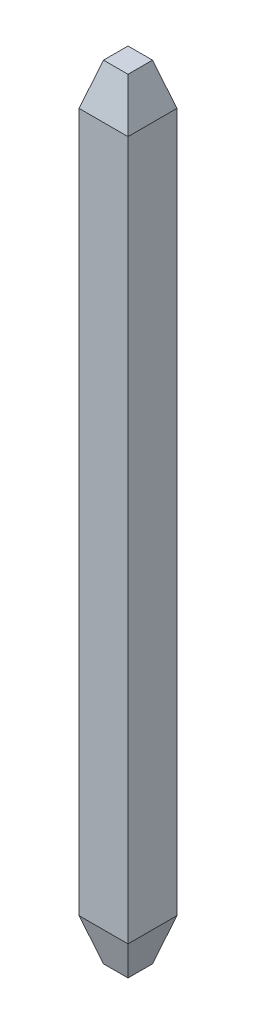
ISO-10303-21;
HEADER;
FILE_DESCRIPTION(('STEP AP214'),'2;1');
FILE_NAME('part.step','',(''),(''),'','','');
FILE_SCHEMA(('AUTOMOTIVE_DESIGN { 1 0 10303 214 1 1 1 1 }'));
ENDSEC;
DATA;
#1=APPLICATION_CONTEXT('core data for automotive mechanical design processes');
#2=APPLICATION_PROTOCOL_DEFINITION('international standard','automotive_design',2000,#1);
#3=PRODUCT_CONTEXT('',#1,'mechanical');
#4=PRODUCT('Part','Part','',(#3));
#5=PRODUCT_RELATED_PRODUCT_CATEGORY('part','',(#4));
#6=PRODUCT_DEFINITION_FORMATION('','',#4);
#7=PRODUCT_DEFINITION_CONTEXT('part definition',#1,'design');
#8=PRODUCT_DEFINITION('design','',#6,#7);
#9=PRODUCT_DEFINITION_SHAPE('','',#8);
#10=(LENGTH_UNIT() NAMED_UNIT(*) SI_UNIT(.MILLI.,.METRE.));
#11=(NAMED_UNIT(*) PLANE_ANGLE_UNIT() SI_UNIT($,.RADIAN.));
#12=(NAMED_UNIT(*) SI_UNIT($,.STERADIAN.) SOLID_ANGLE_UNIT());
#13=UNCERTAINTY_MEASURE_WITH_UNIT(LENGTH_MEASURE(1.E-05),#10,'distance_accuracy_value','');
#14=(GEOMETRIC_REPRESENTATION_CONTEXT(3) GLOBAL_UNCERTAINTY_ASSIGNED_CONTEXT((#13)) GLOBAL_UNIT_ASSIGNED_CONTEXT((#10,
#11,#12)) REPRESENTATION_CONTEXT('',''));
#15=CARTESIAN_POINT('',(0.,0.,0.));
#16=DIRECTION('',(0.,0.,1.));
#17=DIRECTION('',(1.,0.,0.));
#18=AXIS2_PLACEMENT_3D('',#15,#16,#17);
#19=CARTESIAN_POINT('',(6.19000000001294,-10.1039999999831,-16.9799999999763));
#20=DIRECTION('',(-0.959644900900968,-0.281214622974644,0.));
#21=DIRECTION('',(-0.281214622974644,0.959644900900968,0.));
#22=AXIS2_PLACEMENT_3D('',#19,#20,#21);
#23=PLANE('',#22);
#24=DIRECTION('',(0.,0.,-1.));
#25=VECTOR('',#24,1.);
#26=CARTESIAN_POINT('',(6.19000000001294,-10.1039999999831,-16.6599999999763));
#27=LINE('',#26,#25);
#28=CARTESIAN_POINT('',(6.19000000001294,-10.1039999999831,-16.6599999999763));
#29=VERTEX_POINT('',#28);
#30=CARTESIAN_POINT('',(6.19000000001294,-10.1039999999831,-17.2999999999763));
#31=VERTEX_POINT('',#30);
#32=EDGE_CURVE('E11',#29,#31,#27,.T.);
#33=ORIENTED_EDGE('',*,*,#32,.T.);
#34=DIRECTION('',(0.270714017147728,-0.923811583516617,0.270714017147728));
#35=VECTOR('',#34,1.);
#36=CARTESIAN_POINT('',(6.19000000001294,-10.1039999999831,-17.2999999999763));
#37=LINE('',#36,#35);
#38=CARTESIAN_POINT('',(6.35000000001294,-10.6499999999831,-17.1399999999763));
#39=VERTEX_POINT('',#38);
#40=EDGE_CURVE('E28',#31,#39,#37,.T.);
#41=ORIENTED_EDGE('',*,*,#40,.T.);
#42=DIRECTION('',(0.,0.,-1.));
#43=VECTOR('',#42,1.);
#44=CARTESIAN_POINT('',(6.35000000001294,-10.6499999999831,-16.8199999999763));
#45=LINE('',#44,#43);
#46=CARTESIAN_POINT('',(6.35000000001294,-10.6499999999831,-16.8199999999763));
#47=VERTEX_POINT('',#46);
#48=EDGE_CURVE('E163',#47,#39,#45,.T.);
#49=ORIENTED_EDGE('',*,*,#48,.F.);
#50=DIRECTION('',(0.270714017147728,-0.923811583516617,-0.270714017147728));
#51=VECTOR('',#50,1.);
#52=CARTESIAN_POINT('',(6.19000000001294,-10.1039999999831,-16.6599999999763));
#53=LINE('',#52,#51);
#54=EDGE_CURVE('E153',#29,#47,#53,.T.);
#55=ORIENTED_EDGE('',*,*,#54,.F.);
#56=EDGE_LOOP('',(#33,#41,#49,#55));
#57=FACE_BOUND('',#56,.T.);
#58=ADVANCED_FACE('F17',(#57),#23,.T.);
#59=CARTESIAN_POINT('',(6.19000000001294,-5.53543505344786,-16.6589999999763));
#60=DIRECTION('',(-1.,0.,0.));
#61=DIRECTION('',(0.,0.,1.));
#62=AXIS2_PLACEMENT_3D('',#59,#60,#61);
#63=PLANE('',#62);
#64=DIRECTION('',(0.,1.,0.));
#65=VECTOR('',#64,1.);
#66=CARTESIAN_POINT('',(6.19000000001294,-10.1039999999831,-17.2999999999763));
#67=LINE('',#66,#65);
#68=CARTESIAN_POINT('',(6.19000000001294,-0.965870106912631,-17.2999999999763));
#69=VERTEX_POINT('',#68);
#70=EDGE_CURVE('E42',#31,#69,#67,.T.);
#71=ORIENTED_EDGE('',*,*,#70,.F.);
#72=ORIENTED_EDGE('',*,*,#32,.F.);
#73=DIRECTION('',(0.,1.,0.));
#74=VECTOR('',#73,1.);
#75=CARTESIAN_POINT('',(6.19000000001294,-10.1039999999831,-16.6599999999763));
#76=LINE('',#75,#74);
#77=CARTESIAN_POINT('',(6.19000000001294,-0.965870106912631,-16.6599999999763));
#78=VERTEX_POINT('',#77);
#79=EDGE_CURVE('E176',#29,#78,#76,.T.);
#80=ORIENTED_EDGE('',*,*,#79,.T.);
#81=DIRECTION('',(0.,0.,-1.));
#82=VECTOR('',#81,1.);
#83=CARTESIAN_POINT('',(6.19000000001294,-0.965870106912629,-16.6599999999763));
#84=LINE('',#83,#82);
#85=EDGE_CURVE('E171',#78,#69,#84,.T.);
#86=ORIENTED_EDGE('',*,*,#85,.T.);
#87=EDGE_LOOP('',(#71,#72,#80,#86));
#88=FACE_BOUND('',#87,.T.);
#89=ADVANCED_FACE('F219',(#88),#63,.T.);
#90=CARTESIAN_POINT('',(6.83100000001296,-5.53443505344787,-17.2999999999763));
#91=DIRECTION('',(0.,0.,-1.));
#92=DIRECTION('',(0.,-1.,0.));
#93=AXIS2_PLACEMENT_3D('',#90,#91,#92);
#94=PLANE('',#93);
#95=DIRECTION('',(0.,1.,0.));
#96=VECTOR('',#95,1.);
#97=CARTESIAN_POINT('',(6.83000000001296,-10.1039999999831,-17.2999999999763));
#98=LINE('',#97,#96);
#99=CARTESIAN_POINT('',(6.83000000001293,-10.1039999999831,-17.2999999999763));
#100=VERTEX_POINT('',#99);
#101=CARTESIAN_POINT('',(6.83000000001293,-0.965870106912631,-17.2999999999763));
#102=VERTEX_POINT('',#101);
#103=EDGE_CURVE('E118',#100,#102,#98,.T.);
#104=ORIENTED_EDGE('',*,*,#103,.F.);
#105=DIRECTION('',(1.,0.,0.));
#106=VECTOR('',#105,1.);
#107=CARTESIAN_POINT('',(6.19000000001294,-10.1039999999831,-17.2999999999763));
#108=LINE('',#107,#106);
#109=EDGE_CURVE('E99',#31,#100,#108,.T.);
#110=ORIENTED_EDGE('',*,*,#109,.F.);
#111=ORIENTED_EDGE('',*,*,#70,.T.);
#112=DIRECTION('',(1.,0.,0.));
#113=VECTOR('',#112,1.);
#114=CARTESIAN_POINT('',(6.19000000001294,-0.965870106912629,-17.2999999999763));
#115=LINE('',#114,#113);
#116=EDGE_CURVE('E130',#69,#102,#115,.T.);
#117=ORIENTED_EDGE('',*,*,#116,.T.);
#118=EDGE_LOOP('',(#104,#110,#111,#117));
#119=FACE_BOUND('',#118,.T.);
#120=ADVANCED_FACE('F129',(#119),#94,.T.);
#121=CARTESIAN_POINT('',(6.83000000001296,-11.0738701069126,-16.9799999999763));
#122=DIRECTION('',(1.,0.,0.));
#123=DIRECTION('',(0.,1.,0.));
#124=AXIS2_PLACEMENT_3D('',#121,#122,#123);
#125=PLANE('',#124);
#126=DIRECTION('',(0.,1.,0.));
#127=VECTOR('',#126,1.);
#128=CARTESIAN_POINT('',(6.83000000001296,-10.1039999999831,-16.6599999999763));
#129=LINE('',#128,#127);
#130=CARTESIAN_POINT('',(6.83000000001293,-10.1039999999831,-16.6599999999763));
#131=VERTEX_POINT('',#130);
#132=CARTESIAN_POINT('',(6.83000000001293,-0.965870106912631,-16.6599999999763));
#133=VERTEX_POINT('',#132);
#134=EDGE_CURVE('E120',#131,#133,#129,.T.);
#135=ORIENTED_EDGE('',*,*,#134,.F.);
#136=DIRECTION('',(0.,0.,1.));
#137=VECTOR('',#136,1.);
#138=CARTESIAN_POINT('',(6.83000000001296,-10.1039999999831,-17.2999999999763));
#139=LINE('',#138,#137);
#140=EDGE_CURVE('E115',#100,#131,#139,.T.);
#141=ORIENTED_EDGE('',*,*,#140,.F.);
#142=ORIENTED_EDGE('',*,*,#103,.T.);
#143=DIRECTION('',(0.,0.,1.));
#144=VECTOR('',#143,1.);
#145=CARTESIAN_POINT('',(6.83000000001296,-0.965870106912629,-17.2999999999763));
#146=LINE('',#145,#144);
#147=EDGE_CURVE('E133',#102,#133,#146,.T.);
#148=ORIENTED_EDGE('',*,*,#147,.T.);
#149=EDGE_LOOP('',(#135,#141,#142,#148));
#150=FACE_BOUND('',#149,.T.);
#151=ADVANCED_FACE('F116',(#150),#125,.T.);
#152=CARTESIAN_POINT('',(6.83000000001296,-0.965870106912629,-16.9799999999763));
#153=DIRECTION('',(0.959644900900968,0.281214622974643,0.));
#154=DIRECTION('',(0.,0.,-1.));
#155=AXIS2_PLACEMENT_3D('',#152,#153,#154);
#156=PLANE('',#155);
#157=DIRECTION('',(-0.270714017147727,0.923811583516618,0.270714017147727));
#158=VECTOR('',#157,1.);
#159=CARTESIAN_POINT('',(6.83000000001296,-0.965870106912629,-17.2999999999763));
#160=LINE('',#159,#158);
#161=CARTESIAN_POINT('',(6.67000000001293,-0.419870106912635,-17.1399999999763));
#162=VERTEX_POINT('',#161);
#163=EDGE_CURVE('E21',#102,#162,#160,.T.);
#164=ORIENTED_EDGE('',*,*,#163,.T.);
#165=DIRECTION('',(0.,0.,1.));
#166=VECTOR('',#165,1.);
#167=CARTESIAN_POINT('',(6.67000000001296,-0.419870106912629,-17.1399999999763));
#168=LINE('',#167,#166);
#169=CARTESIAN_POINT('',(6.67000000001293,-0.419870106912635,-16.8199999999763));
#170=VERTEX_POINT('',#169);
#171=EDGE_CURVE('E149',#162,#170,#168,.T.);
#172=ORIENTED_EDGE('',*,*,#171,.T.);
#173=DIRECTION('',(-0.270714017147727,0.923811583516618,-0.270714017147727));
#174=VECTOR('',#173,1.);
#175=CARTESIAN_POINT('',(6.83000000001296,-0.965870106912629,-16.6599999999763));
#176=LINE('',#175,#174);
#177=EDGE_CURVE('E146',#133,#170,#176,.T.);
#178=ORIENTED_EDGE('',*,*,#177,.F.);
#179=ORIENTED_EDGE('',*,*,#147,.F.);
#180=EDGE_LOOP('',(#164,#172,#178,#179));
#181=FACE_BOUND('',#180,.T.);
#182=ADVANCED_FACE('F231',(#181),#156,.T.);
#183=CARTESIAN_POINT('',(6.51000000001295,-0.965870106912629,-16.6599999999763));
#184=DIRECTION('',(0.,0.281214622974643,0.959644900900968));
#185=DIRECTION('',(1.,0.,0.));
#186=AXIS2_PLACEMENT_3D('',#183,#184,#185);
#187=PLANE('',#186);
#188=ORIENTED_EDGE('',*,*,#177,.T.);
#189=DIRECTION('',(-1.,0.,0.));
#190=VECTOR('',#189,1.);
#191=CARTESIAN_POINT('',(6.67000000001296,-0.419870106912629,-16.8199999999763));
#192=LINE('',#191,#190);
#193=CARTESIAN_POINT('',(6.35000000001294,-0.419870106912635,-16.8199999999763));
#194=VERTEX_POINT('',#193);
#195=EDGE_CURVE('E126',#170,#194,#192,.T.);
#196=ORIENTED_EDGE('',*,*,#195,.T.);
#197=DIRECTION('',(0.270714017147727,0.923811583516618,-0.270714017147727));
#198=VECTOR('',#197,1.);
#199=CARTESIAN_POINT('',(6.19000000001294,-0.965870106912629,-16.6599999999763));
#200=LINE('',#199,#198);
#201=EDGE_CURVE('E145',#78,#194,#200,.T.);
#202=ORIENTED_EDGE('',*,*,#201,.F.);
#203=DIRECTION('',(-1.,0.,0.));
#204=VECTOR('',#203,1.);
#205=CARTESIAN_POINT('',(6.83000000001296,-0.965870106912629,-16.6599999999763));
#206=LINE('',#205,#204);
#207=EDGE_CURVE('E200',#133,#78,#206,.T.);
#208=ORIENTED_EDGE('',*,*,#207,.F.);
#209=EDGE_LOOP('',(#188,#196,#202,#208));
#210=FACE_BOUND('',#209,.T.);
#211=ADVANCED_FACE('F234',(#210),#187,.T.);
#212=CARTESIAN_POINT('',(6.51000000001295,-0.419870106912629,-17.1409999999763));
#213=DIRECTION('',(0.,1.,0.));
#214=DIRECTION('',(1.,0.,0.));
#215=AXIS2_PLACEMENT_3D('',#212,#213,#214);
#216=PLANE('',#215);
#217=DIRECTION('',(1.,0.,0.));
#218=VECTOR('',#217,1.);
#219=CARTESIAN_POINT('',(6.35000000001294,-0.419870106912629,-17.1399999999763));
#220=LINE('',#219,#218);
#221=CARTESIAN_POINT('',(6.35000000001294,-0.419870106912635,-17.1399999999763));
#222=VERTEX_POINT('',#221);
#223=EDGE_CURVE('E167',#222,#162,#220,.T.);
#224=ORIENTED_EDGE('',*,*,#223,.F.);
#225=DIRECTION('',(0.,0.,-1.));
#226=VECTOR('',#225,1.);
#227=CARTESIAN_POINT('',(6.35000000001294,-0.419870106912629,-16.8199999999763));
#228=LINE('',#227,#226);
#229=EDGE_CURVE('E194',#194,#222,#228,.T.);
#230=ORIENTED_EDGE('',*,*,#229,.F.);
#231=ORIENTED_EDGE('',*,*,#195,.F.);
#232=ORIENTED_EDGE('',*,*,#171,.F.);
#233=EDGE_LOOP('',(#224,#230,#231,#232));
#234=FACE_BOUND('',#233,.T.);
#235=ADVANCED_FACE('F238',(#234),#216,.T.);
#236=CARTESIAN_POINT('',(6.83000000001296,-10.1039999999831,-16.9799999999763));
#237=DIRECTION('',(0.959644900900968,-0.281214622974644,0.));
#238=DIRECTION('',(0.,0.,-1.));
#239=AXIS2_PLACEMENT_3D('',#236,#237,#238);
#240=PLANE('',#239);
#241=ORIENTED_EDGE('',*,*,#140,.T.);
#242=DIRECTION('',(-0.270714017147728,-0.923811583516617,-0.270714017147728));
#243=VECTOR('',#242,1.);
#244=CARTESIAN_POINT('',(6.83000000001296,-10.1039999999831,-16.6599999999763));
#245=LINE('',#244,#243);
#246=CARTESIAN_POINT('',(6.67000000001293,-10.6499999999831,-16.8199999999763));
#247=VERTEX_POINT('',#246);
#248=EDGE_CURVE('E127',#131,#247,#245,.T.);
#249=ORIENTED_EDGE('',*,*,#248,.T.);
#250=DIRECTION('',(0.,0.,1.));
#251=VECTOR('',#250,1.);
#252=CARTESIAN_POINT('',(6.67000000001296,-10.6499999999831,-17.1399999999763));
#253=LINE('',#252,#251);
#254=CARTESIAN_POINT('',(6.67000000001293,-10.6499999999831,-17.1399999999763));
#255=VERTEX_POINT('',#254);
#256=EDGE_CURVE('E136',#255,#247,#253,.T.);
#257=ORIENTED_EDGE('',*,*,#256,.F.);
#258=DIRECTION('',(-0.270714017147728,-0.923811583516617,0.270714017147728));
#259=VECTOR('',#258,1.);
#260=CARTESIAN_POINT('',(6.83000000001296,-10.1039999999831,-17.2999999999763));
#261=LINE('',#260,#259);
#262=EDGE_CURVE('E104',#100,#255,#261,.T.);
#263=ORIENTED_EDGE('',*,*,#262,.F.);
#264=EDGE_LOOP('',(#241,#249,#257,#263));
#265=FACE_BOUND('',#264,.T.);
#266=ADVANCED_FACE('F135',(#265),#240,.T.);
#267=CARTESIAN_POINT('',(6.51000000001295,-0.965870106912629,-17.2999999999763));
#268=DIRECTION('',(0.,0.281214622974643,-0.959644900900968));
#269=DIRECTION('',(-1.,0.,0.));
#270=AXIS2_PLACEMENT_3D('',#267,#268,#269);
#271=PLANE('',#270);
#272=DIRECTION('',(0.270714017147727,0.923811583516618,0.270714017147727));
#273=VECTOR('',#272,1.);
#274=CARTESIAN_POINT('',(6.19000000001294,-0.965870106912629,-17.2999999999763));
#275=LINE('',#274,#273);
#276=EDGE_CURVE('E152',#69,#222,#275,.T.);
#277=ORIENTED_EDGE('',*,*,#276,.T.);
#278=ORIENTED_EDGE('',*,*,#223,.T.);
#279=ORIENTED_EDGE('',*,*,#163,.F.);
#280=ORIENTED_EDGE('',*,*,#116,.F.);
#281=EDGE_LOOP('',(#277,#278,#279,#280));
#282=FACE_BOUND('',#281,.T.);
#283=ADVANCED_FACE('F19',(#282),#271,.T.);
#284=CARTESIAN_POINT('',(6.19000000001294,-0.965870106912629,-16.9799999999763));
#285=DIRECTION('',(-0.959644900900968,0.281214622974643,0.));
#286=DIRECTION('',(0.,0.,1.));
#287=AXIS2_PLACEMENT_3D('',#284,#285,#286);
#288=PLANE('',#287);
#289=ORIENTED_EDGE('',*,*,#201,.T.);
#290=ORIENTED_EDGE('',*,*,#229,.T.);
#291=ORIENTED_EDGE('',*,*,#276,.F.);
#292=ORIENTED_EDGE('',*,*,#85,.F.);
#293=EDGE_LOOP('',(#289,#290,#291,#292));
#294=FACE_BOUND('',#293,.T.);
#295=ADVANCED_FACE('F251',(#294),#288,.T.);
#296=CARTESIAN_POINT('',(6.18900000001297,-5.53543505344787,-16.6599999999763));
#297=DIRECTION('',(0.,0.,1.));
#298=DIRECTION('',(1.,0.,0.));
#299=AXIS2_PLACEMENT_3D('',#296,#297,#298);
#300=PLANE('',#299);
#301=ORIENTED_EDGE('',*,*,#79,.F.);
#302=DIRECTION('',(-1.,0.,0.));
#303=VECTOR('',#302,1.);
#304=CARTESIAN_POINT('',(6.83000000001296,-10.1039999999831,-16.6599999999763));
#305=LINE('',#304,#303);
#306=EDGE_CURVE('E157',#131,#29,#305,.T.);
#307=ORIENTED_EDGE('',*,*,#306,.F.);
#308=ORIENTED_EDGE('',*,*,#134,.T.);
#309=ORIENTED_EDGE('',*,*,#207,.T.);
#310=EDGE_LOOP('',(#301,#307,#308,#309));
#311=FACE_BOUND('',#310,.T.);
#312=ADVANCED_FACE('F217',(#311),#300,.T.);
#313=CARTESIAN_POINT('',(6.51000000001295,-10.1039999999831,-16.6599999999763));
#314=DIRECTION('',(0.,-0.281214622974644,0.959644900900968));
#315=DIRECTION('',(-1.,0.,0.));
#316=AXIS2_PLACEMENT_3D('',#313,#314,#315);
#317=PLANE('',#316);
#318=ORIENTED_EDGE('',*,*,#306,.T.);
#319=ORIENTED_EDGE('',*,*,#54,.T.);
#320=DIRECTION('',(-1.,0.,0.));
#321=VECTOR('',#320,1.);
#322=CARTESIAN_POINT('',(6.67000000001296,-10.6499999999831,-16.8199999999763));
#323=LINE('',#322,#321);
#324=EDGE_CURVE('E166',#247,#47,#323,.T.);
#325=ORIENTED_EDGE('',*,*,#324,.F.);
#326=ORIENTED_EDGE('',*,*,#248,.F.);
#327=EDGE_LOOP('',(#318,#319,#325,#326));
#328=FACE_BOUND('',#327,.T.);
#329=ADVANCED_FACE('F212',(#328),#317,.T.);
#330=CARTESIAN_POINT('',(6.34900000001296,-10.6499999999831,-16.9799999999763));
#331=DIRECTION('',(0.,-1.,0.));
#332=DIRECTION('',(0.,0.,-1.));
#333=AXIS2_PLACEMENT_3D('',#330,#331,#332);
#334=PLANE('',#333);
#335=ORIENTED_EDGE('',*,*,#256,.T.);
#336=ORIENTED_EDGE('',*,*,#324,.T.);
#337=ORIENTED_EDGE('',*,*,#48,.T.);
#338=DIRECTION('',(1.,0.,0.));
#339=VECTOR('',#338,1.);
#340=CARTESIAN_POINT('',(6.35000000001294,-10.6499999999831,-17.1399999999763));
#341=LINE('',#340,#339);
#342=EDGE_CURVE('E110',#39,#255,#341,.T.);
#343=ORIENTED_EDGE('',*,*,#342,.T.);
#344=EDGE_LOOP('',(#335,#336,#337,#343));
#345=FACE_BOUND('',#344,.T.);
#346=ADVANCED_FACE('F208',(#345),#334,.T.);
#347=CARTESIAN_POINT('',(6.51000000001295,-10.1039999999831,-17.2999999999763));
#348=DIRECTION('',(0.,-0.281214622974644,-0.959644900900968));
#349=DIRECTION('',(0.,-0.959644900900968,0.281214622974644));
#350=AXIS2_PLACEMENT_3D('',#347,#348,#349);
#351=PLANE('',#350);
#352=ORIENTED_EDGE('',*,*,#109,.T.);
#353=ORIENTED_EDGE('',*,*,#262,.T.);
#354=ORIENTED_EDGE('',*,*,#342,.F.);
#355=ORIENTED_EDGE('',*,*,#40,.F.);
#356=EDGE_LOOP('',(#352,#353,#354,#355));
#357=FACE_BOUND('',#356,.T.);
#358=ADVANCED_FACE('F101',(#357),#351,.T.);
#359=CLOSED_SHELL('',(#58,#89,#120,#151,#182,#211,#235,#266,#283,#295,#312,#329,#346,#358));
#360=MANIFOLD_SOLID_BREP('B1',#359);
#361=ADVANCED_BREP_SHAPE_REPRESENTATION('',(#18,#360),#14);
#362=SHAPE_DEFINITION_REPRESENTATION(#9,#361);
ENDSEC;
END-ISO-10303-21;
